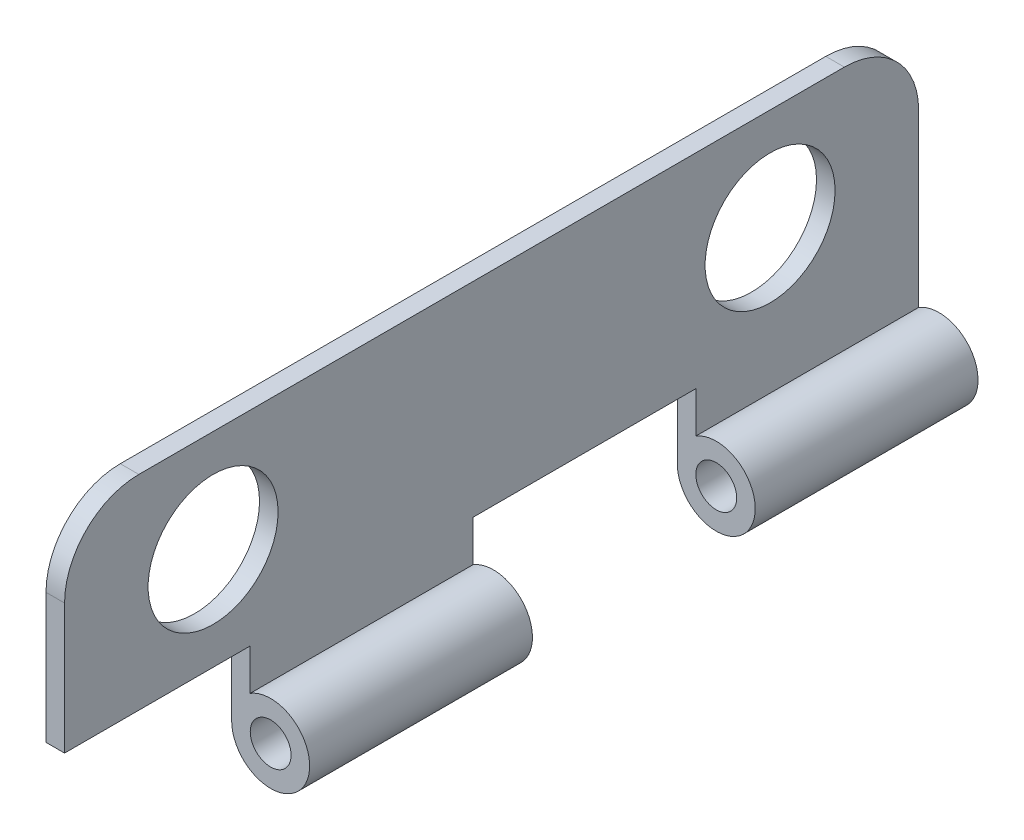
ISO-10303-21;
HEADER;
FILE_DESCRIPTION(('STEP AP214'),'2;1');
FILE_NAME('part.step','',(''),(''),'','','');
FILE_SCHEMA(('AUTOMOTIVE_DESIGN { 1 0 10303 214 1 1 1 1 }'));
ENDSEC;
DATA;
#1=APPLICATION_CONTEXT('core data for automotive mechanical design processes');
#2=APPLICATION_PROTOCOL_DEFINITION('international standard','automotive_design',2000,#1);
#3=PRODUCT_CONTEXT('',#1,'mechanical');
#4=PRODUCT('Part','Part','',(#3));
#5=PRODUCT_RELATED_PRODUCT_CATEGORY('part','',(#4));
#6=PRODUCT_DEFINITION_FORMATION('','',#4);
#7=PRODUCT_DEFINITION_CONTEXT('part definition',#1,'design');
#8=PRODUCT_DEFINITION('design','',#6,#7);
#9=PRODUCT_DEFINITION_SHAPE('','',#8);
#10=(LENGTH_UNIT() NAMED_UNIT(*) SI_UNIT(.MILLI.,.METRE.));
#11=(NAMED_UNIT(*) PLANE_ANGLE_UNIT() SI_UNIT($,.RADIAN.));
#12=(NAMED_UNIT(*) SI_UNIT($,.STERADIAN.) SOLID_ANGLE_UNIT());
#13=UNCERTAINTY_MEASURE_WITH_UNIT(LENGTH_MEASURE(1.E-05),#10,'distance_accuracy_value','');
#14=(GEOMETRIC_REPRESENTATION_CONTEXT(3) GLOBAL_UNCERTAINTY_ASSIGNED_CONTEXT((#13)) GLOBAL_UNIT_ASSIGNED_CONTEXT((#10,
#11,#12)) REPRESENTATION_CONTEXT('',''));
#15=CARTESIAN_POINT('',(0.,0.,0.));
#16=DIRECTION('',(0.,0.,1.));
#17=DIRECTION('',(1.,0.,0.));
#18=AXIS2_PLACEMENT_3D('',#15,#16,#17);
#19=CARTESIAN_POINT('',(-0.55,0.,6.));
#20=DIRECTION('',(-1.,0.,0.));
#21=DIRECTION('',(0.,0.,1.));
#22=AXIS2_PLACEMENT_3D('',#19,#20,#21);
#23=PLANE('',#22);
#24=CARTESIAN_POINT('',(-0.55,4.75,19.));
#25=DIRECTION('',(1.,0.,0.));
#26=DIRECTION('',(0.,0.,-1.));
#27=AXIS2_PLACEMENT_3D('',#24,#25,#26);
#28=CIRCLE('',#27,1.75);
#29=CARTESIAN_POINT('',(-0.55,4.75,17.25));
#30=VERTEX_POINT('',#29);
#31=EDGE_CURVE('E160',#30,#30,#28,.T.);
#32=ORIENTED_EDGE('',*,*,#31,.F.);
#33=EDGE_LOOP('',(#32));
#34=FACE_BOUND('',#33,.T.);
#35=CARTESIAN_POINT('',(-0.55,4.75,4.));
#36=DIRECTION('',(1.,0.,0.));
#37=DIRECTION('',(0.,0.,-1.));
#38=AXIS2_PLACEMENT_3D('',#35,#36,#37);
#39=CIRCLE('',#38,1.75);
#40=CARTESIAN_POINT('',(-0.55,4.75,2.25));
#41=VERTEX_POINT('',#40);
#42=EDGE_CURVE('E163',#41,#41,#39,.T.);
#43=ORIENTED_EDGE('',*,*,#42,.F.);
#44=EDGE_LOOP('',(#43));
#45=FACE_BOUND('',#44,.T.);
#46=DIRECTION('',(0.,1.,0.));
#47=VECTOR('',#46,1.);
#48=CARTESIAN_POINT('',(-0.55,0.,0.));
#49=LINE('',#48,#47);
#50=CARTESIAN_POINT('',(-0.55,0.894427190999916,0.));
#51=VERTEX_POINT('',#50);
#52=CARTESIAN_POINT('',(-0.55,5.5,0.));
#53=VERTEX_POINT('',#52);
#54=EDGE_CURVE('E212',#51,#53,#49,.T.);
#55=ORIENTED_EDGE('',*,*,#54,.T.);
#56=CARTESIAN_POINT('',(-0.55,5.5,2.));
#57=DIRECTION('',(-1.,0.,0.));
#58=DIRECTION('',(0.,0.,1.));
#59=AXIS2_PLACEMENT_3D('',#56,#57,#58);
#60=CIRCLE('',#59,2.);
#61=CARTESIAN_POINT('',(-0.55,7.5,2.));
#62=VERTEX_POINT('',#61);
#63=EDGE_CURVE('E44',#53,#62,#60,.F.);
#64=ORIENTED_EDGE('',*,*,#63,.T.);
#65=DIRECTION('',(0.,0.,-1.));
#66=VECTOR('',#65,1.);
#67=CARTESIAN_POINT('',(-0.55,7.5,6.));
#68=LINE('',#67,#66);
#69=CARTESIAN_POINT('',(-0.55,7.5,21.));
#70=VERTEX_POINT('',#69);
#71=EDGE_CURVE('E218',#70,#62,#68,.T.);
#72=ORIENTED_EDGE('',*,*,#71,.F.);
#73=CARTESIAN_POINT('',(-0.55,5.5,21.));
#74=DIRECTION('',(-1.,0.,0.));
#75=DIRECTION('',(0.,0.,1.));
#76=AXIS2_PLACEMENT_3D('',#73,#74,#75);
#77=CIRCLE('',#76,2.);
#78=CARTESIAN_POINT('',(-0.55,5.5,23.));
#79=VERTEX_POINT('',#78);
#80=EDGE_CURVE('E51',#70,#79,#77,.F.);
#81=ORIENTED_EDGE('',*,*,#80,.T.);
#82=DIRECTION('',(0.,-1.,0.));
#83=VECTOR('',#82,1.);
#84=CARTESIAN_POINT('',(-0.55,1.05,23.));
#85=LINE('',#84,#83);
#86=CARTESIAN_POINT('',(-0.55,2.,23.));
#87=VERTEX_POINT('',#86);
#88=EDGE_CURVE('E191',#79,#87,#85,.T.);
#89=ORIENTED_EDGE('',*,*,#88,.T.);
#90=DIRECTION('',(0.,0.,-1.));
#91=VECTOR('',#90,1.);
#92=CARTESIAN_POINT('',(-0.55,2.,6.));
#93=LINE('',#92,#91);
#94=CARTESIAN_POINT('',(-0.55,2.,18.));
#95=VERTEX_POINT('',#94);
#96=EDGE_CURVE('E153',#87,#95,#93,.T.);
#97=ORIENTED_EDGE('',*,*,#96,.T.);
#98=DIRECTION('',(0.,1.,0.));
#99=VECTOR('',#98,1.);
#100=CARTESIAN_POINT('',(-0.55,0.,18.));
#101=LINE('',#100,#99);
#102=CARTESIAN_POINT('',(-0.55,0.894427190999916,18.));
#103=VERTEX_POINT('',#102);
#104=EDGE_CURVE('E178',#103,#95,#101,.T.);
#105=ORIENTED_EDGE('',*,*,#104,.F.);
#106=DIRECTION('',(0.,0.,-1.));
#107=VECTOR('',#106,1.);
#108=CARTESIAN_POINT('',(-0.55,0.894427190999916,18.));
#109=LINE('',#108,#107);
#110=CARTESIAN_POINT('',(-0.55,0.894427190999916,12.));
#111=VERTEX_POINT('',#110);
#112=EDGE_CURVE('E131',#103,#111,#109,.T.);
#113=ORIENTED_EDGE('',*,*,#112,.T.);
#114=DIRECTION('',(0.,1.,0.));
#115=VECTOR('',#114,1.);
#116=CARTESIAN_POINT('',(-0.55,0.,12.));
#117=LINE('',#116,#115);
#118=CARTESIAN_POINT('',(-0.55,2.,12.));
#119=VERTEX_POINT('',#118);
#120=EDGE_CURVE('E125',#111,#119,#117,.T.);
#121=ORIENTED_EDGE('',*,*,#120,.T.);
#122=DIRECTION('',(0.,0.,-1.));
#123=VECTOR('',#122,1.);
#124=CARTESIAN_POINT('',(-0.55,2.,6.));
#125=LINE('',#124,#123);
#126=CARTESIAN_POINT('',(-0.55,2.,6.));
#127=VERTEX_POINT('',#126);
#128=EDGE_CURVE('E129',#119,#127,#125,.T.);
#129=ORIENTED_EDGE('',*,*,#128,.T.);
#130=DIRECTION('',(0.,1.,0.));
#131=VECTOR('',#130,1.);
#132=CARTESIAN_POINT('',(-0.55,0.,6.));
#133=LINE('',#132,#131);
#134=CARTESIAN_POINT('',(-0.55,0.894427190999916,6.));
#135=VERTEX_POINT('',#134);
#136=EDGE_CURVE('E201',#135,#127,#133,.T.);
#137=ORIENTED_EDGE('',*,*,#136,.F.);
#138=DIRECTION('',(0.,0.,-1.));
#139=VECTOR('',#138,1.);
#140=CARTESIAN_POINT('',(-0.55,0.894427190999916,6.));
#141=LINE('',#140,#139);
#142=EDGE_CURVE('E209',#135,#51,#141,.T.);
#143=ORIENTED_EDGE('',*,*,#142,.T.);
#144=EDGE_LOOP('',(#55,#64,#72,#81,#89,#97,#105,#113,#121,#129,#137,#143));
#145=FACE_BOUND('',#144,.T.);
#146=ADVANCED_FACE('F36',(#34,#45,#145),#23,.F.);
#147=CARTESIAN_POINT('',(0.,7.5,6.));
#148=DIRECTION('',(0.,-1.,0.));
#149=DIRECTION('',(0.,0.,-1.));
#150=AXIS2_PLACEMENT_3D('',#147,#148,#149);
#151=PLANE('',#150);
#152=ORIENTED_EDGE('',*,*,#71,.T.);
#153=DIRECTION('',(-1.,0.,0.));
#154=VECTOR('',#153,1.);
#155=CARTESIAN_POINT('',(-1.05,7.5,2.));
#156=LINE('',#155,#154);
#157=CARTESIAN_POINT('',(-1.05,7.5,2.));
#158=VERTEX_POINT('',#157);
#159=EDGE_CURVE('E230',#62,#158,#156,.T.);
#160=ORIENTED_EDGE('',*,*,#159,.T.);
#161=DIRECTION('',(0.,0.,-1.));
#162=VECTOR('',#161,1.);
#163=CARTESIAN_POINT('',(-1.05,7.5,6.));
#164=LINE('',#163,#162);
#165=CARTESIAN_POINT('',(-1.05,7.5,21.));
#166=VERTEX_POINT('',#165);
#167=EDGE_CURVE('E222',#166,#158,#164,.T.);
#168=ORIENTED_EDGE('',*,*,#167,.F.);
#169=DIRECTION('',(1.,0.,0.));
#170=VECTOR('',#169,1.);
#171=CARTESIAN_POINT('',(-0.55,7.5,21.));
#172=LINE('',#171,#170);
#173=EDGE_CURVE('E221',#166,#70,#172,.T.);
#174=ORIENTED_EDGE('',*,*,#173,.T.);
#175=EDGE_LOOP('',(#152,#160,#168,#174));
#176=FACE_BOUND('',#175,.T.);
#177=ADVANCED_FACE('F242',(#176),#151,.F.);
#178=CARTESIAN_POINT('',(-1.05,0.,6.));
#179=DIRECTION('',(-1.,0.,0.));
#180=DIRECTION('',(0.,0.,1.));
#181=AXIS2_PLACEMENT_3D('',#178,#179,#180);
#182=PLANE('',#181);
#183=CARTESIAN_POINT('',(-1.05,4.75,19.));
#184=DIRECTION('',(1.,0.,0.));
#185=DIRECTION('',(0.,0.,-1.));
#186=AXIS2_PLACEMENT_3D('',#183,#184,#185);
#187=CIRCLE('',#186,1.75);
#188=CARTESIAN_POINT('',(-1.05,4.75,17.25));
#189=VERTEX_POINT('',#188);
#190=EDGE_CURVE('E154',#189,#189,#187,.T.);
#191=ORIENTED_EDGE('',*,*,#190,.T.);
#192=EDGE_LOOP('',(#191));
#193=FACE_BOUND('',#192,.T.);
#194=CARTESIAN_POINT('',(-1.05,4.75,4.));
#195=DIRECTION('',(1.,0.,0.));
#196=DIRECTION('',(0.,0.,-1.));
#197=AXIS2_PLACEMENT_3D('',#194,#195,#196);
#198=CIRCLE('',#197,1.75);
#199=CARTESIAN_POINT('',(-1.05,4.75,2.25));
#200=VERTEX_POINT('',#199);
#201=EDGE_CURVE('E340',#200,#200,#198,.T.);
#202=ORIENTED_EDGE('',*,*,#201,.T.);
#203=EDGE_LOOP('',(#202));
#204=FACE_BOUND('',#203,.T.);
#205=ORIENTED_EDGE('',*,*,#167,.T.);
#206=CARTESIAN_POINT('',(-1.05,5.5,2.));
#207=DIRECTION('',(-1.,0.,0.));
#208=DIRECTION('',(0.,0.,1.));
#209=AXIS2_PLACEMENT_3D('',#206,#207,#208);
#210=CIRCLE('',#209,2.);
#211=CARTESIAN_POINT('',(-1.05,5.5,0.));
#212=VERTEX_POINT('',#211);
#213=EDGE_CURVE('E235',#158,#212,#210,.T.);
#214=ORIENTED_EDGE('',*,*,#213,.T.);
#215=DIRECTION('',(0.,1.,0.));
#216=VECTOR('',#215,1.);
#217=CARTESIAN_POINT('',(-1.05,0.,0.));
#218=LINE('',#217,#216);
#219=CARTESIAN_POINT('',(-1.05,0.,0.));
#220=VERTEX_POINT('',#219);
#221=EDGE_CURVE('E202',#220,#212,#218,.T.);
#222=ORIENTED_EDGE('',*,*,#221,.F.);
#223=DIRECTION('',(0.,0.,-1.));
#224=VECTOR('',#223,1.);
#225=CARTESIAN_POINT('',(-1.05,0.,6.));
#226=LINE('',#225,#224);
#227=CARTESIAN_POINT('',(-1.05,0.,6.));
#228=VERTEX_POINT('',#227);
#229=EDGE_CURVE('E225',#228,#220,#226,.T.);
#230=ORIENTED_EDGE('',*,*,#229,.F.);
#231=DIRECTION('',(0.,1.,0.));
#232=VECTOR('',#231,1.);
#233=CARTESIAN_POINT('',(-1.05,0.,6.));
#234=LINE('',#233,#232);
#235=CARTESIAN_POINT('',(-1.05,2.,6.));
#236=VERTEX_POINT('',#235);
#237=EDGE_CURVE('E207',#228,#236,#234,.T.);
#238=ORIENTED_EDGE('',*,*,#237,.T.);
#239=DIRECTION('',(0.,0.,-1.));
#240=VECTOR('',#239,1.);
#241=CARTESIAN_POINT('',(-1.05,2.,6.));
#242=LINE('',#241,#240);
#243=CARTESIAN_POINT('',(-1.05,2.,12.));
#244=VERTEX_POINT('',#243);
#245=EDGE_CURVE('E148',#244,#236,#242,.T.);
#246=ORIENTED_EDGE('',*,*,#245,.F.);
#247=DIRECTION('',(0.,1.,0.));
#248=VECTOR('',#247,1.);
#249=CARTESIAN_POINT('',(-1.05,0.,12.));
#250=LINE('',#249,#248);
#251=CARTESIAN_POINT('',(-1.05,0.,12.));
#252=VERTEX_POINT('',#251);
#253=EDGE_CURVE('E143',#252,#244,#250,.T.);
#254=ORIENTED_EDGE('',*,*,#253,.F.);
#255=DIRECTION('',(0.,0.,-1.));
#256=VECTOR('',#255,1.);
#257=CARTESIAN_POINT('',(-1.05,0.,18.));
#258=LINE('',#257,#256);
#259=CARTESIAN_POINT('',(-1.05,0.,18.));
#260=VERTEX_POINT('',#259);
#261=EDGE_CURVE('E189',#260,#252,#258,.T.);
#262=ORIENTED_EDGE('',*,*,#261,.F.);
#263=DIRECTION('',(0.,1.,0.));
#264=VECTOR('',#263,1.);
#265=CARTESIAN_POINT('',(-1.05,0.,18.));
#266=LINE('',#265,#264);
#267=CARTESIAN_POINT('',(-1.05,2.,18.));
#268=VERTEX_POINT('',#267);
#269=EDGE_CURVE('E183',#260,#268,#266,.T.);
#270=ORIENTED_EDGE('',*,*,#269,.T.);
#271=DIRECTION('',(0.,0.,-1.));
#272=VECTOR('',#271,1.);
#273=CARTESIAN_POINT('',(-1.05,2.,18.));
#274=LINE('',#273,#272);
#275=CARTESIAN_POINT('',(-1.05,2.,23.));
#276=VERTEX_POINT('',#275);
#277=EDGE_CURVE('E157',#276,#268,#274,.T.);
#278=ORIENTED_EDGE('',*,*,#277,.F.);
#279=DIRECTION('',(0.,1.,0.));
#280=VECTOR('',#279,1.);
#281=CARTESIAN_POINT('',(-1.05,1.05,23.));
#282=LINE('',#281,#280);
#283=CARTESIAN_POINT('',(-1.05,5.5,23.));
#284=VERTEX_POINT('',#283);
#285=EDGE_CURVE('E193',#276,#284,#282,.T.);
#286=ORIENTED_EDGE('',*,*,#285,.T.);
#287=CARTESIAN_POINT('',(-1.05,5.5,21.));
#288=DIRECTION('',(-1.,0.,0.));
#289=DIRECTION('',(0.,0.,1.));
#290=AXIS2_PLACEMENT_3D('',#287,#288,#289);
#291=CIRCLE('',#290,2.);
#292=EDGE_CURVE('E233',#284,#166,#291,.T.);
#293=ORIENTED_EDGE('',*,*,#292,.T.);
#294=EDGE_LOOP('',(#205,#214,#222,#230,#238,#246,#254,#262,#270,#278,#286,#293));
#295=FACE_BOUND('',#294,.T.);
#296=ADVANCED_FACE('F248',(#193,#204,#295),#182,.T.);
#297=CARTESIAN_POINT('',(0.,0.,6.));
#298=DIRECTION('',(0.,0.,-1.));
#299=DIRECTION('',(-1.,0.,0.));
#300=AXIS2_PLACEMENT_3D('',#297,#298,#299);
#301=CYLINDRICAL_SURFACE('',#300,0.55);
#302=CARTESIAN_POINT('',(0.,0.,6.));
#303=DIRECTION('',(0.,0.,-1.));
#304=DIRECTION('',(-1.,0.,0.));
#305=AXIS2_PLACEMENT_3D('',#302,#303,#304);
#306=CIRCLE('',#305,0.55);
#307=CARTESIAN_POINT('',(-0.55,0.,6.));
#308=VERTEX_POINT('',#307);
#309=EDGE_CURVE('E198',#308,#308,#306,.T.);
#310=ORIENTED_EDGE('',*,*,#309,.F.);
#311=EDGE_LOOP('',(#310));
#312=FACE_BOUND('',#311,.T.);
#313=CARTESIAN_POINT('',(0.,0.,0.));
#314=DIRECTION('',(0.,0.,-1.));
#315=DIRECTION('',(-1.,0.,0.));
#316=AXIS2_PLACEMENT_3D('',#313,#314,#315);
#317=CIRCLE('',#316,0.55);
#318=CARTESIAN_POINT('',(-0.55,0.,0.));
#319=VERTEX_POINT('',#318);
#320=EDGE_CURVE('E196',#319,#319,#317,.T.);
#321=ORIENTED_EDGE('',*,*,#320,.T.);
#322=EDGE_LOOP('',(#321));
#323=FACE_BOUND('',#322,.T.);
#324=ADVANCED_FACE('F297',(#312,#323),#301,.F.);
#325=CARTESIAN_POINT('',(0.,0.,6.));
#326=DIRECTION('',(0.,0.,-1.));
#327=DIRECTION('',(-1.,0.,0.));
#328=AXIS2_PLACEMENT_3D('',#325,#326,#327);
#329=CYLINDRICAL_SURFACE('',#328,1.05);
#330=CARTESIAN_POINT('',(0.,0.,0.));
#331=DIRECTION('',(0.,0.,-1.));
#332=DIRECTION('',(-1.,0.,0.));
#333=AXIS2_PLACEMENT_3D('',#330,#331,#332);
#334=CIRCLE('',#333,1.05);
#335=EDGE_CURVE('E214',#51,#220,#334,.T.);
#336=ORIENTED_EDGE('',*,*,#335,.F.);
#337=ORIENTED_EDGE('',*,*,#142,.F.);
#338=CARTESIAN_POINT('',(0.,0.,6.));
#339=DIRECTION('',(0.,0.,-1.));
#340=DIRECTION('',(-1.,0.,0.));
#341=AXIS2_PLACEMENT_3D('',#338,#339,#340);
#342=CIRCLE('',#341,1.05);
#343=EDGE_CURVE('E204',#135,#228,#342,.T.);
#344=ORIENTED_EDGE('',*,*,#343,.T.);
#345=ORIENTED_EDGE('',*,*,#229,.T.);
#346=EDGE_LOOP('',(#336,#337,#344,#345));
#347=FACE_BOUND('',#346,.T.);
#348=ADVANCED_FACE('F252',(#347),#329,.T.);
#349=CARTESIAN_POINT('',(0.,0.,6.));
#350=DIRECTION('',(0.,0.,-1.));
#351=DIRECTION('',(-1.,0.,0.));
#352=AXIS2_PLACEMENT_3D('',#349,#350,#351);
#353=PLANE('',#352);
#354=ORIENTED_EDGE('',*,*,#237,.F.);
#355=ORIENTED_EDGE('',*,*,#343,.F.);
#356=ORIENTED_EDGE('',*,*,#136,.T.);
#357=DIRECTION('',(-1.,0.,0.));
#358=VECTOR('',#357,1.);
#359=CARTESIAN_POINT('',(-0.6,2.,6.));
#360=LINE('',#359,#358);
#361=EDGE_CURVE('E147',#127,#236,#360,.T.);
#362=ORIENTED_EDGE('',*,*,#361,.T.);
#363=EDGE_LOOP('',(#354,#355,#356,#362));
#364=FACE_BOUND('',#363,.T.);
#365=ORIENTED_EDGE('',*,*,#309,.T.);
#366=EDGE_LOOP('',(#365));
#367=FACE_BOUND('',#366,.T.);
#368=ADVANCED_FACE('F256',(#364,#367),#353,.F.);
#369=CARTESIAN_POINT('',(0.,0.,0.));
#370=DIRECTION('',(0.,0.,-1.));
#371=DIRECTION('',(-1.,0.,0.));
#372=AXIS2_PLACEMENT_3D('',#369,#370,#371);
#373=PLANE('',#372);
#374=ORIENTED_EDGE('',*,*,#320,.F.);
#375=EDGE_LOOP('',(#374));
#376=FACE_BOUND('',#375,.T.);
#377=ORIENTED_EDGE('',*,*,#221,.T.);
#378=DIRECTION('',(-1.,0.,0.));
#379=VECTOR('',#378,1.);
#380=CARTESIAN_POINT('',(-0.55,5.5,0.));
#381=LINE('',#380,#379);
#382=EDGE_CURVE('E59',#212,#53,#381,.F.);
#383=ORIENTED_EDGE('',*,*,#382,.T.);
#384=ORIENTED_EDGE('',*,*,#54,.F.);
#385=ORIENTED_EDGE('',*,*,#335,.T.);
#386=EDGE_LOOP('',(#377,#383,#384,#385));
#387=FACE_BOUND('',#386,.T.);
#388=ADVANCED_FACE('F249',(#376,#387),#373,.T.);
#389=CARTESIAN_POINT('',(0.,0.,23.));
#390=DIRECTION('',(0.,0.,1.));
#391=DIRECTION('',(1.,0.,0.));
#392=AXIS2_PLACEMENT_3D('',#389,#390,#391);
#393=PLANE('',#392);
#394=ORIENTED_EDGE('',*,*,#88,.F.);
#395=DIRECTION('',(1.,0.,0.));
#396=VECTOR('',#395,1.);
#397=CARTESIAN_POINT('',(-1.05,5.5,23.));
#398=LINE('',#397,#396);
#399=EDGE_CURVE('E12',#79,#284,#398,.F.);
#400=ORIENTED_EDGE('',*,*,#399,.T.);
#401=ORIENTED_EDGE('',*,*,#285,.F.);
#402=DIRECTION('',(-1.,0.,0.));
#403=VECTOR('',#402,1.);
#404=CARTESIAN_POINT('',(-0.6,2.,23.));
#405=LINE('',#404,#403);
#406=EDGE_CURVE('E171',#87,#276,#405,.T.);
#407=ORIENTED_EDGE('',*,*,#406,.F.);
#408=EDGE_LOOP('',(#394,#400,#401,#407));
#409=FACE_BOUND('',#408,.T.);
#410=ADVANCED_FACE('F272',(#409),#393,.T.);
#411=CARTESIAN_POINT('',(0.,0.,18.));
#412=DIRECTION('',(0.,0.,-1.));
#413=DIRECTION('',(-1.,0.,0.));
#414=AXIS2_PLACEMENT_3D('',#411,#412,#413);
#415=PLANE('',#414);
#416=ORIENTED_EDGE('',*,*,#269,.F.);
#417=CARTESIAN_POINT('',(0.,0.,18.));
#418=DIRECTION('',(0.,0.,-1.));
#419=DIRECTION('',(-1.,0.,0.));
#420=AXIS2_PLACEMENT_3D('',#417,#418,#419);
#421=CIRCLE('',#420,1.05);
#422=EDGE_CURVE('E180',#103,#260,#421,.T.);
#423=ORIENTED_EDGE('',*,*,#422,.F.);
#424=ORIENTED_EDGE('',*,*,#104,.T.);
#425=DIRECTION('',(-1.,0.,0.));
#426=VECTOR('',#425,1.);
#427=CARTESIAN_POINT('',(-0.6,2.,18.));
#428=LINE('',#427,#426);
#429=EDGE_CURVE('E167',#95,#268,#428,.T.);
#430=ORIENTED_EDGE('',*,*,#429,.T.);
#431=EDGE_LOOP('',(#416,#423,#424,#430));
#432=FACE_BOUND('',#431,.T.);
#433=CARTESIAN_POINT('',(0.,0.,18.));
#434=DIRECTION('',(0.,0.,-1.));
#435=DIRECTION('',(-1.,0.,0.));
#436=AXIS2_PLACEMENT_3D('',#433,#434,#435);
#437=CIRCLE('',#436,0.55);
#438=CARTESIAN_POINT('',(-0.55,0.,18.));
#439=VERTEX_POINT('',#438);
#440=EDGE_CURVE('E175',#439,#439,#437,.T.);
#441=ORIENTED_EDGE('',*,*,#440,.T.);
#442=EDGE_LOOP('',(#441));
#443=FACE_BOUND('',#442,.T.);
#444=ADVANCED_FACE('F263',(#432,#443),#415,.F.);
#445=CARTESIAN_POINT('',(0.,0.,12.));
#446=DIRECTION('',(0.,0.,-1.));
#447=DIRECTION('',(-1.,0.,0.));
#448=AXIS2_PLACEMENT_3D('',#445,#446,#447);
#449=PLANE('',#448);
#450=CARTESIAN_POINT('',(0.,0.,12.));
#451=DIRECTION('',(0.,0.,-1.));
#452=DIRECTION('',(-1.,0.,0.));
#453=AXIS2_PLACEMENT_3D('',#450,#451,#452);
#454=CIRCLE('',#453,1.05);
#455=EDGE_CURVE('E135',#111,#252,#454,.T.);
#456=ORIENTED_EDGE('',*,*,#455,.T.);
#457=ORIENTED_EDGE('',*,*,#253,.T.);
#458=DIRECTION('',(-1.,0.,0.));
#459=VECTOR('',#458,1.);
#460=CARTESIAN_POINT('',(-0.6,2.,12.));
#461=LINE('',#460,#459);
#462=EDGE_CURVE('E139',#119,#244,#461,.T.);
#463=ORIENTED_EDGE('',*,*,#462,.F.);
#464=ORIENTED_EDGE('',*,*,#120,.F.);
#465=EDGE_LOOP('',(#456,#457,#463,#464));
#466=FACE_BOUND('',#465,.T.);
#467=CARTESIAN_POINT('',(0.,0.,12.));
#468=DIRECTION('',(0.,0.,-1.));
#469=DIRECTION('',(-1.,0.,0.));
#470=AXIS2_PLACEMENT_3D('',#467,#468,#469);
#471=CIRCLE('',#470,0.55);
#472=CARTESIAN_POINT('',(-0.55,0.,12.));
#473=VERTEX_POINT('',#472);
#474=EDGE_CURVE('E136',#473,#473,#471,.T.);
#475=ORIENTED_EDGE('',*,*,#474,.F.);
#476=EDGE_LOOP('',(#475));
#477=FACE_BOUND('',#476,.T.);
#478=ADVANCED_FACE('F140',(#466,#477),#449,.T.);
#479=CARTESIAN_POINT('',(0.,0.,18.));
#480=DIRECTION('',(0.,0.,-1.));
#481=DIRECTION('',(-1.,0.,0.));
#482=AXIS2_PLACEMENT_3D('',#479,#480,#481);
#483=CYLINDRICAL_SURFACE('',#482,0.55);
#484=ORIENTED_EDGE('',*,*,#440,.F.);
#485=EDGE_LOOP('',(#484));
#486=FACE_BOUND('',#485,.T.);
#487=ORIENTED_EDGE('',*,*,#474,.T.);
#488=EDGE_LOOP('',(#487));
#489=FACE_BOUND('',#488,.T.);
#490=ADVANCED_FACE('F318',(#486,#489),#483,.F.);
#491=CARTESIAN_POINT('',(0.,0.,18.));
#492=DIRECTION('',(0.,0.,-1.));
#493=DIRECTION('',(-1.,0.,0.));
#494=AXIS2_PLACEMENT_3D('',#491,#492,#493);
#495=CYLINDRICAL_SURFACE('',#494,1.05);
#496=ORIENTED_EDGE('',*,*,#455,.F.);
#497=ORIENTED_EDGE('',*,*,#112,.F.);
#498=ORIENTED_EDGE('',*,*,#422,.T.);
#499=ORIENTED_EDGE('',*,*,#261,.T.);
#500=EDGE_LOOP('',(#496,#497,#498,#499));
#501=FACE_BOUND('',#500,.T.);
#502=ADVANCED_FACE('F260',(#501),#495,.T.);
#503=CARTESIAN_POINT('',(-0.6,2.,18.));
#504=DIRECTION('',(0.,1.,0.));
#505=DIRECTION('',(0.,0.,1.));
#506=AXIS2_PLACEMENT_3D('',#503,#504,#505);
#507=PLANE('',#506);
#508=ORIENTED_EDGE('',*,*,#277,.T.);
#509=ORIENTED_EDGE('',*,*,#429,.F.);
#510=ORIENTED_EDGE('',*,*,#96,.F.);
#511=ORIENTED_EDGE('',*,*,#406,.T.);
#512=EDGE_LOOP('',(#508,#509,#510,#511));
#513=FACE_BOUND('',#512,.T.);
#514=ADVANCED_FACE('F324',(#513),#507,.F.);
#515=CARTESIAN_POINT('',(-0.6,2.,6.));
#516=DIRECTION('',(0.,1.,0.));
#517=DIRECTION('',(0.,0.,1.));
#518=AXIS2_PLACEMENT_3D('',#515,#516,#517);
#519=PLANE('',#518);
#520=ORIENTED_EDGE('',*,*,#245,.T.);
#521=ORIENTED_EDGE('',*,*,#361,.F.);
#522=ORIENTED_EDGE('',*,*,#128,.F.);
#523=ORIENTED_EDGE('',*,*,#462,.T.);
#524=EDGE_LOOP('',(#520,#521,#522,#523));
#525=FACE_BOUND('',#524,.T.);
#526=ADVANCED_FACE('F151',(#525),#519,.F.);
#527=CARTESIAN_POINT('',(0.,5.5,2.));
#528=DIRECTION('',(1.,0.,0.));
#529=DIRECTION('',(0.,0.,-1.));
#530=AXIS2_PLACEMENT_3D('',#527,#528,#529);
#531=CYLINDRICAL_SURFACE('',#530,2.);
#532=ORIENTED_EDGE('',*,*,#63,.F.);
#533=ORIENTED_EDGE('',*,*,#382,.F.);
#534=ORIENTED_EDGE('',*,*,#213,.F.);
#535=ORIENTED_EDGE('',*,*,#159,.F.);
#536=EDGE_LOOP('',(#532,#533,#534,#535));
#537=FACE_BOUND('',#536,.T.);
#538=ADVANCED_FACE('F245',(#537),#531,.T.);
#539=CARTESIAN_POINT('',(0.,5.5,21.));
#540=DIRECTION('',(-1.,0.,0.));
#541=DIRECTION('',(0.,0.,1.));
#542=AXIS2_PLACEMENT_3D('',#539,#540,#541);
#543=CYLINDRICAL_SURFACE('',#542,2.);
#544=ORIENTED_EDGE('',*,*,#292,.F.);
#545=ORIENTED_EDGE('',*,*,#399,.F.);
#546=ORIENTED_EDGE('',*,*,#80,.F.);
#547=ORIENTED_EDGE('',*,*,#173,.F.);
#548=EDGE_LOOP('',(#544,#545,#546,#547));
#549=FACE_BOUND('',#548,.T.);
#550=ADVANCED_FACE('F38',(#549),#543,.T.);
#551=CARTESIAN_POINT('',(-1.05,4.75,4.));
#552=DIRECTION('',(1.,0.,0.));
#553=DIRECTION('',(0.,0.,-1.));
#554=AXIS2_PLACEMENT_3D('',#551,#552,#553);
#555=CYLINDRICAL_SURFACE('',#554,1.75);
#556=ORIENTED_EDGE('',*,*,#201,.F.);
#557=EDGE_LOOP('',(#556));
#558=FACE_BOUND('',#557,.T.);
#559=ORIENTED_EDGE('',*,*,#42,.T.);
#560=EDGE_LOOP('',(#559));
#561=FACE_BOUND('',#560,.T.);
#562=ADVANCED_FACE('F277',(#558,#561),#555,.F.);
#563=CARTESIAN_POINT('',(-1.05,4.75,19.));
#564=DIRECTION('',(1.,0.,0.));
#565=DIRECTION('',(0.,0.,-1.));
#566=AXIS2_PLACEMENT_3D('',#563,#564,#565);
#567=CYLINDRICAL_SURFACE('',#566,1.75);
#568=ORIENTED_EDGE('',*,*,#190,.F.);
#569=EDGE_LOOP('',(#568));
#570=FACE_BOUND('',#569,.T.);
#571=ORIENTED_EDGE('',*,*,#31,.T.);
#572=EDGE_LOOP('',(#571));
#573=FACE_BOUND('',#572,.T.);
#574=ADVANCED_FACE('F282',(#570,#573),#567,.F.);
#575=CLOSED_SHELL('',(#146,#177,#296,#324,#348,#368,#388,#410,#444,#478,#490,#502,#514,#526,
#538,#550,#562,#574));
#576=MANIFOLD_SOLID_BREP('B2',#575);
#577=ADVANCED_BREP_SHAPE_REPRESENTATION('',(#18,#576),#14);
#578=SHAPE_DEFINITION_REPRESENTATION(#9,#577);
ENDSEC;
END-ISO-10303-21;
